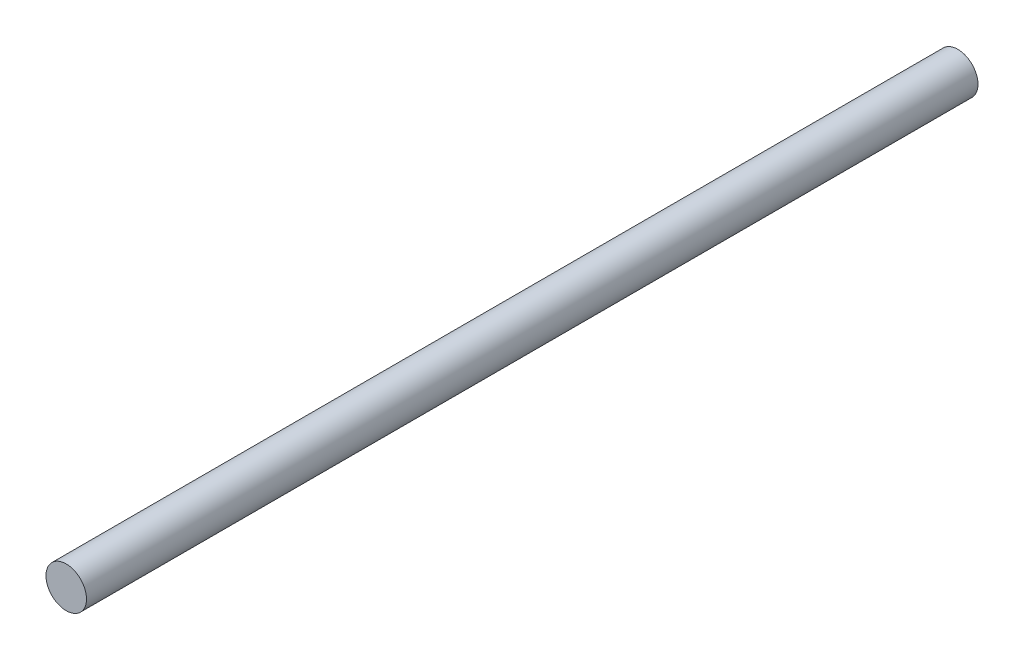
ISO-10303-21;
HEADER;
FILE_DESCRIPTION(('STEP AP214'),'2;1');
FILE_NAME('part.step','',(''),(''),'','','');
FILE_SCHEMA(('AUTOMOTIVE_DESIGN { 1 0 10303 214 1 1 1 1 }'));
ENDSEC;
DATA;
#1=APPLICATION_CONTEXT('core data for automotive mechanical design processes');
#2=APPLICATION_PROTOCOL_DEFINITION('international standard','automotive_design',2000,#1);
#3=PRODUCT_CONTEXT('',#1,'mechanical');
#4=PRODUCT('Part','Part','',(#3));
#5=PRODUCT_RELATED_PRODUCT_CATEGORY('part','',(#4));
#6=PRODUCT_DEFINITION_FORMATION('','',#4);
#7=PRODUCT_DEFINITION_CONTEXT('part definition',#1,'design');
#8=PRODUCT_DEFINITION('design','',#6,#7);
#9=PRODUCT_DEFINITION_SHAPE('','',#8);
#10=(LENGTH_UNIT() NAMED_UNIT(*) SI_UNIT(.MILLI.,.METRE.));
#11=(NAMED_UNIT(*) PLANE_ANGLE_UNIT() SI_UNIT($,.RADIAN.));
#12=(NAMED_UNIT(*) SI_UNIT($,.STERADIAN.) SOLID_ANGLE_UNIT());
#13=UNCERTAINTY_MEASURE_WITH_UNIT(LENGTH_MEASURE(1.E-05),#10,'distance_accuracy_value','');
#14=(GEOMETRIC_REPRESENTATION_CONTEXT(3) GLOBAL_UNCERTAINTY_ASSIGNED_CONTEXT((#13)) GLOBAL_UNIT_ASSIGNED_CONTEXT((#10,
#11,#12)) REPRESENTATION_CONTEXT('',''));
#15=CARTESIAN_POINT('',(0.,0.,0.));
#16=DIRECTION('',(0.,0.,1.));
#17=DIRECTION('',(1.,0.,0.));
#18=AXIS2_PLACEMENT_3D('',#15,#16,#17);
#19=CARTESIAN_POINT('',(0.,0.,22.));
#20=DIRECTION('',(0.,0.,-1.));
#21=DIRECTION('',(-1.,0.,0.));
#22=AXIS2_PLACEMENT_3D('',#19,#20,#21);
#23=CYLINDRICAL_SURFACE('',#22,0.5);
#24=CARTESIAN_POINT('',(0.,0.,22.));
#25=DIRECTION('',(0.,0.,1.));
#26=DIRECTION('',(1.,0.,0.));
#27=AXIS2_PLACEMENT_3D('',#24,#25,#26);
#28=CIRCLE('',#27,0.5);
#29=CARTESIAN_POINT('',(0.5,0.,22.));
#30=VERTEX_POINT('',#29);
#31=EDGE_CURVE('E10',#30,#30,#28,.T.);
#32=ORIENTED_EDGE('',*,*,#31,.F.);
#33=EDGE_LOOP('',(#32));
#34=FACE_BOUND('',#33,.T.);
#35=CARTESIAN_POINT('',(0.,0.,0.));
#36=DIRECTION('',(0.,0.,1.));
#37=DIRECTION('',(1.,0.,0.));
#38=AXIS2_PLACEMENT_3D('',#35,#36,#37);
#39=CIRCLE('',#38,0.5);
#40=CARTESIAN_POINT('',(0.5,0.,0.));
#41=VERTEX_POINT('',#40);
#42=EDGE_CURVE('E34',#41,#41,#39,.T.);
#43=ORIENTED_EDGE('',*,*,#42,.T.);
#44=EDGE_LOOP('',(#43));
#45=FACE_BOUND('',#44,.T.);
#46=ADVANCED_FACE('F31',(#34,#45),#23,.T.);
#47=CARTESIAN_POINT('',(0.,0.,22.));
#48=DIRECTION('',(0.,0.,1.));
#49=DIRECTION('',(1.,0.,0.));
#50=AXIS2_PLACEMENT_3D('',#47,#48,#49);
#51=PLANE('',#50);
#52=ORIENTED_EDGE('',*,*,#31,.T.);
#53=EDGE_LOOP('',(#52));
#54=FACE_BOUND('',#53,.T.);
#55=ADVANCED_FACE('F46',(#54),#51,.T.);
#56=CARTESIAN_POINT('',(0.,0.,0.));
#57=DIRECTION('',(0.,0.,1.));
#58=DIRECTION('',(1.,0.,0.));
#59=AXIS2_PLACEMENT_3D('',#56,#57,#58);
#60=PLANE('',#59);
#61=ORIENTED_EDGE('',*,*,#42,.F.);
#62=EDGE_LOOP('',(#61));
#63=FACE_BOUND('',#62,.T.);
#64=ADVANCED_FACE('F44',(#63),#60,.F.);
#65=CLOSED_SHELL('',(#46,#55,#64));
#66=MANIFOLD_SOLID_BREP('B2',#65);
#67=ADVANCED_BREP_SHAPE_REPRESENTATION('',(#18,#66),#14);
#68=SHAPE_DEFINITION_REPRESENTATION(#9,#67);
ENDSEC;
END-ISO-10303-21;
